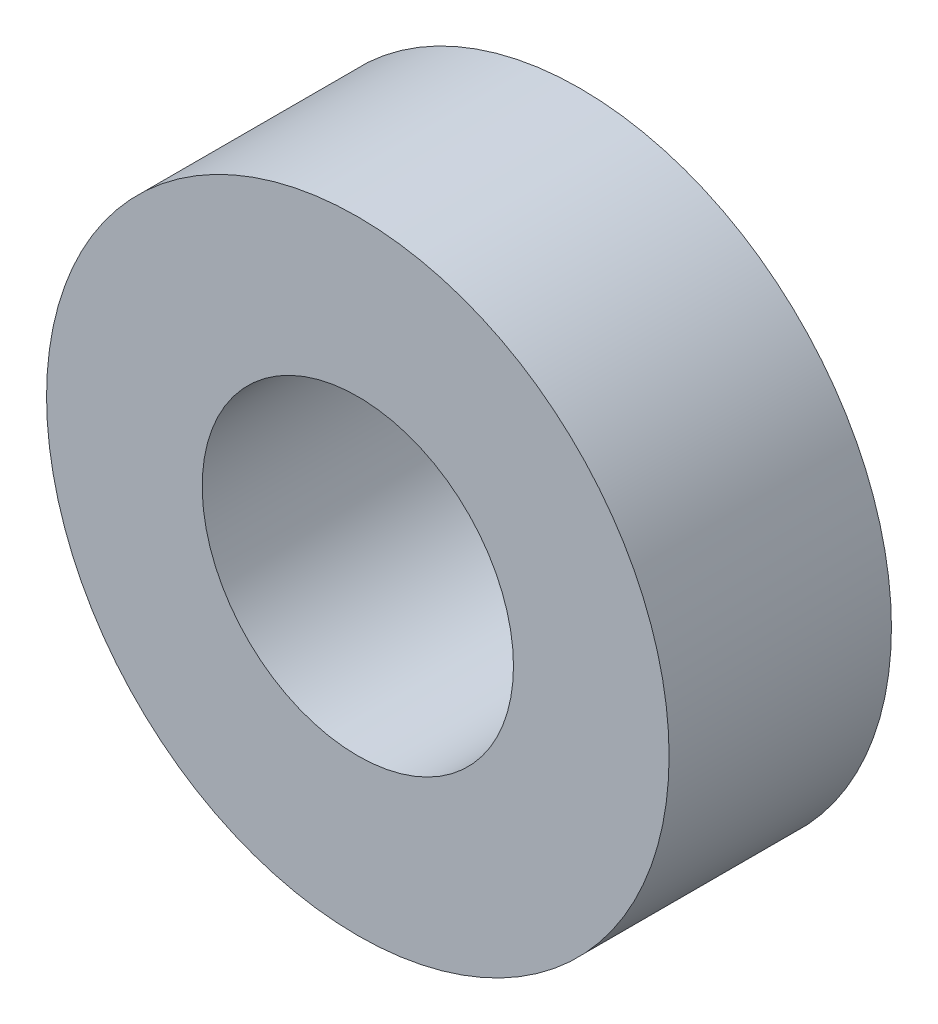
ISO-10303-21;
HEADER;
FILE_DESCRIPTION(('STEP AP214'),'2;1');
FILE_NAME('part.step','',(''),(''),'','','');
FILE_SCHEMA(('AUTOMOTIVE_DESIGN { 1 0 10303 214 1 1 1 1 }'));
ENDSEC;
DATA;
#1=APPLICATION_CONTEXT('core data for automotive mechanical design processes');
#2=APPLICATION_PROTOCOL_DEFINITION('international standard','automotive_design',2000,#1);
#3=PRODUCT_CONTEXT('',#1,'mechanical');
#4=PRODUCT('Part','Part','',(#3));
#5=PRODUCT_RELATED_PRODUCT_CATEGORY('part','',(#4));
#6=PRODUCT_DEFINITION_FORMATION('','',#4);
#7=PRODUCT_DEFINITION_CONTEXT('part definition',#1,'design');
#8=PRODUCT_DEFINITION('design','',#6,#7);
#9=PRODUCT_DEFINITION_SHAPE('','',#8);
#10=(LENGTH_UNIT() NAMED_UNIT(*) SI_UNIT(.MILLI.,.METRE.));
#11=(NAMED_UNIT(*) PLANE_ANGLE_UNIT() SI_UNIT($,.RADIAN.));
#12=(NAMED_UNIT(*) SI_UNIT($,.STERADIAN.) SOLID_ANGLE_UNIT());
#13=UNCERTAINTY_MEASURE_WITH_UNIT(LENGTH_MEASURE(1.E-05),#10,'distance_accuracy_value','');
#14=(GEOMETRIC_REPRESENTATION_CONTEXT(3) GLOBAL_UNCERTAINTY_ASSIGNED_CONTEXT((#13)) GLOBAL_UNIT_ASSIGNED_CONTEXT((#10,
#11,#12)) REPRESENTATION_CONTEXT('',''));
#15=CARTESIAN_POINT('',(0.,0.,0.));
#16=DIRECTION('',(0.,0.,1.));
#17=DIRECTION('',(1.,0.,0.));
#18=AXIS2_PLACEMENT_3D('',#15,#16,#17);
#19=CARTESIAN_POINT('',(0.,0.,0.));
#20=DIRECTION('',(0.,0.,1.));
#21=DIRECTION('',(1.,0.,0.));
#22=AXIS2_PLACEMENT_3D('',#19,#20,#21);
#23=CYLINDRICAL_SURFACE('',#22,2.625);
#24=CARTESIAN_POINT('',(0.,0.,3.75));
#25=DIRECTION('',(0.,0.,-1.));
#26=DIRECTION('',(0.,-1.,0.));
#27=AXIS2_PLACEMENT_3D('',#24,#25,#26);
#28=CIRCLE('',#27,2.625);
#29=CARTESIAN_POINT('',(0.,-2.625,3.75));
#30=VERTEX_POINT('',#29);
#31=EDGE_CURVE('E8',#30,#30,#28,.T.);
#32=ORIENTED_EDGE('',*,*,#31,.F.);
#33=EDGE_LOOP('',(#32));
#34=FACE_BOUND('',#33,.T.);
#35=CARTESIAN_POINT('',(0.,0.,0.));
#36=DIRECTION('',(0.,0.,1.));
#37=DIRECTION('',(1.,0.,0.));
#38=AXIS2_PLACEMENT_3D('',#35,#36,#37);
#39=CIRCLE('',#38,2.625);
#40=CARTESIAN_POINT('',(2.625,0.,0.));
#41=VERTEX_POINT('',#40);
#42=EDGE_CURVE('E25',#41,#41,#39,.T.);
#43=ORIENTED_EDGE('',*,*,#42,.F.);
#44=EDGE_LOOP('',(#43));
#45=FACE_BOUND('',#44,.T.);
#46=ADVANCED_FACE('F13',(#34,#45),#23,.F.);
#47=CARTESIAN_POINT('',(0.,0.,0.));
#48=DIRECTION('',(0.,0.,1.));
#49=DIRECTION('',(1.,0.,0.));
#50=AXIS2_PLACEMENT_3D('',#47,#48,#49);
#51=CYLINDRICAL_SURFACE('',#50,5.25);
#52=CARTESIAN_POINT('',(0.,0.,3.75));
#53=DIRECTION('',(0.,0.,1.));
#54=DIRECTION('',(1.,0.,0.));
#55=AXIS2_PLACEMENT_3D('',#52,#53,#54);
#56=CIRCLE('',#55,5.25);
#57=CARTESIAN_POINT('',(5.25,0.,3.75));
#58=VERTEX_POINT('',#57);
#59=EDGE_CURVE('E20',#58,#58,#56,.T.);
#60=ORIENTED_EDGE('',*,*,#59,.F.);
#61=EDGE_LOOP('',(#60));
#62=FACE_BOUND('',#61,.T.);
#63=CARTESIAN_POINT('',(0.,0.,0.));
#64=DIRECTION('',(0.,0.,-1.));
#65=DIRECTION('',(0.,-1.,0.));
#66=AXIS2_PLACEMENT_3D('',#63,#64,#65);
#67=CIRCLE('',#66,5.25);
#68=CARTESIAN_POINT('',(0.,-5.25,0.));
#69=VERTEX_POINT('',#68);
#70=EDGE_CURVE('E16',#69,#69,#67,.T.);
#71=ORIENTED_EDGE('',*,*,#70,.F.);
#72=EDGE_LOOP('',(#71));
#73=FACE_BOUND('',#72,.T.);
#74=ADVANCED_FACE('F35',(#62,#73),#51,.T.);
#75=CARTESIAN_POINT('',(0.,0.,3.75));
#76=DIRECTION('',(0.,0.,1.));
#77=DIRECTION('',(1.,0.,0.));
#78=AXIS2_PLACEMENT_3D('',#75,#76,#77);
#79=PLANE('',#78);
#80=ORIENTED_EDGE('',*,*,#31,.T.);
#81=EDGE_LOOP('',(#80));
#82=FACE_BOUND('',#81,.T.);
#83=ORIENTED_EDGE('',*,*,#59,.T.);
#84=EDGE_LOOP('',(#83));
#85=FACE_BOUND('',#84,.T.);
#86=ADVANCED_FACE('F37',(#82,#85),#79,.T.);
#87=CARTESIAN_POINT('',(0.,0.,0.));
#88=DIRECTION('',(0.,0.,1.));
#89=DIRECTION('',(1.,0.,0.));
#90=AXIS2_PLACEMENT_3D('',#87,#88,#89);
#91=PLANE('',#90);
#92=ORIENTED_EDGE('',*,*,#42,.T.);
#93=EDGE_LOOP('',(#92));
#94=FACE_BOUND('',#93,.T.);
#95=ORIENTED_EDGE('',*,*,#70,.T.);
#96=EDGE_LOOP('',(#95));
#97=FACE_BOUND('',#96,.T.);
#98=ADVANCED_FACE('F33',(#94,#97),#91,.F.);
#99=CLOSED_SHELL('',(#46,#74,#86,#98));
#100=MANIFOLD_SOLID_BREP('B1',#99);
#101=ADVANCED_BREP_SHAPE_REPRESENTATION('',(#18,#100),#14);
#102=SHAPE_DEFINITION_REPRESENTATION(#9,#101);
ENDSEC;
END-ISO-10303-21;
